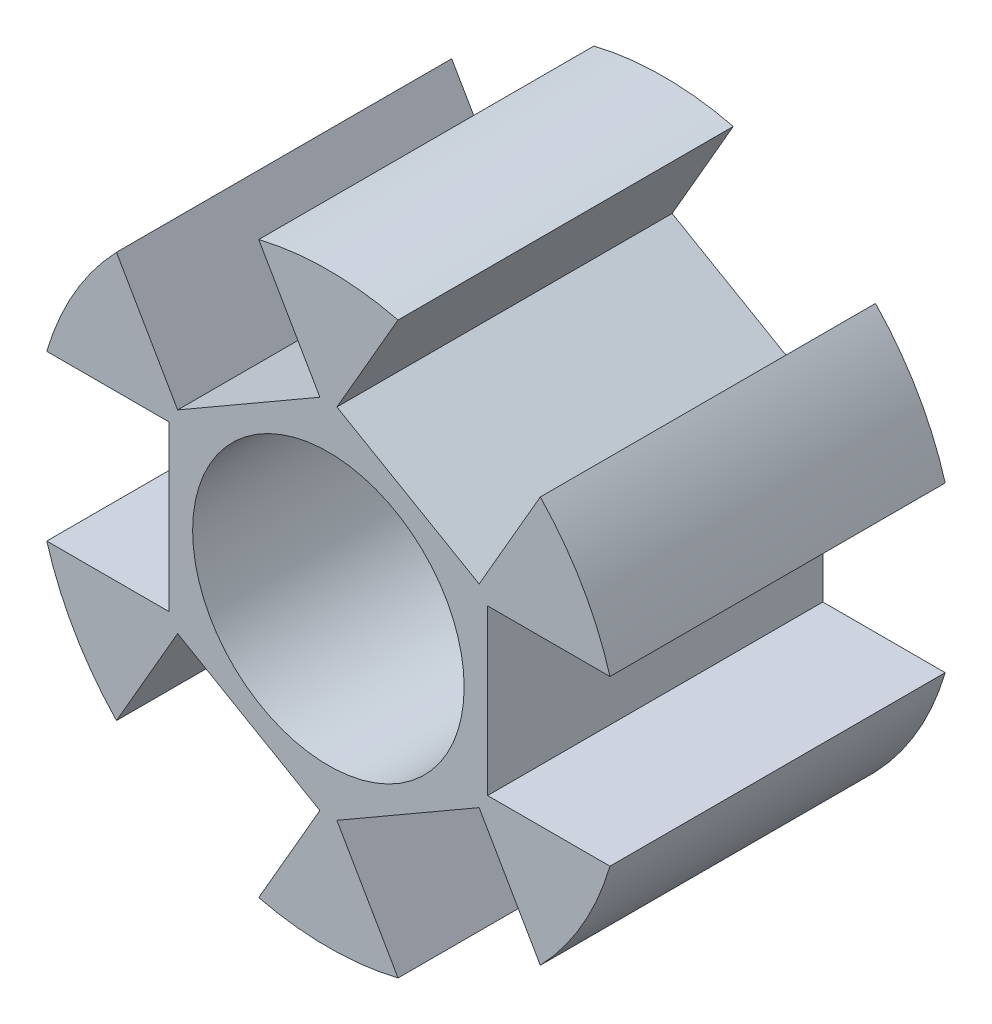
ISO-10303-21;
HEADER;
FILE_DESCRIPTION(('STEP AP214'),'2;1');
FILE_NAME('part.step','',(''),(''),'','','');
FILE_SCHEMA(('AUTOMOTIVE_DESIGN { 1 0 10303 214 1 1 1 1 }'));
ENDSEC;
DATA;
#1=APPLICATION_CONTEXT('core data for automotive mechanical design processes');
#2=APPLICATION_PROTOCOL_DEFINITION('international standard','automotive_design',2000,#1);
#3=PRODUCT_CONTEXT('',#1,'mechanical');
#4=PRODUCT('Part','Part','',(#3));
#5=PRODUCT_RELATED_PRODUCT_CATEGORY('part','',(#4));
#6=PRODUCT_DEFINITION_FORMATION('','',#4);
#7=PRODUCT_DEFINITION_CONTEXT('part definition',#1,'design');
#8=PRODUCT_DEFINITION('design','',#6,#7);
#9=PRODUCT_DEFINITION_SHAPE('','',#8);
#10=(LENGTH_UNIT() NAMED_UNIT(*) SI_UNIT(.MILLI.,.METRE.));
#11=(NAMED_UNIT(*) PLANE_ANGLE_UNIT() SI_UNIT($,.RADIAN.));
#12=(NAMED_UNIT(*) SI_UNIT($,.STERADIAN.) SOLID_ANGLE_UNIT());
#13=UNCERTAINTY_MEASURE_WITH_UNIT(LENGTH_MEASURE(1.E-05),#10,'distance_accuracy_value','');
#14=(GEOMETRIC_REPRESENTATION_CONTEXT(3) GLOBAL_UNCERTAINTY_ASSIGNED_CONTEXT((#13)) GLOBAL_UNIT_ASSIGNED_CONTEXT((#10,
#11,#12)) REPRESENTATION_CONTEXT('',''));
#15=CARTESIAN_POINT('',(0.,0.,0.));
#16=DIRECTION('',(0.,0.,1.));
#17=DIRECTION('',(1.,0.,0.));
#18=AXIS2_PLACEMENT_3D('',#15,#16,#17);
#19=CARTESIAN_POINT('',(0.,0.,5.));
#20=DIRECTION('',(0.,0.,1.));
#21=DIRECTION('',(1.,0.,0.));
#22=AXIS2_PLACEMENT_3D('',#19,#20,#21);
#23=PLANE('',#22);
#24=CARTESIAN_POINT('',(0.,0.,5.));
#25=DIRECTION('',(0.,0.,1.));
#26=DIRECTION('',(1.,0.,0.));
#27=AXIS2_PLACEMENT_3D('',#24,#25,#26);
#28=CIRCLE('',#27,4.05);
#29=CARTESIAN_POINT('',(4.05,0.,5.));
#30=VERTEX_POINT('',#29);
#31=EDGE_CURVE('E337',#30,#30,#28,.T.);
#32=ORIENTED_EDGE('',*,*,#31,.F.);
#33=EDGE_LOOP('',(#32));
#34=FACE_BOUND('',#33,.T.);
#35=DIRECTION('',(-0.866025403784433,-0.50000000000001,0.));
#36=VECTOR('',#35,1.);
#37=CARTESIAN_POINT('',(-0.253237760728186,5.33862066797608,5.));
#38=LINE('',#37,#36);
#39=CARTESIAN_POINT('',(-0.253237760728186,5.33862066797608,5.));
#40=VERTEX_POINT('',#39);
#41=CARTESIAN_POINT('',(-4.49676223927191,2.88862066797603,5.));
#42=VERTEX_POINT('',#41);
#43=EDGE_CURVE('E285',#40,#42,#38,.T.);
#44=ORIENTED_EDGE('',*,*,#43,.T.);
#45=DIRECTION('',(-0.50000000000001,0.866025403784433,0.));
#46=VECTOR('',#45,1.);
#47=CARTESIAN_POINT('',(-4.49676223927191,2.88862066797603,5.));
#48=LINE('',#47,#46);
#49=CARTESIAN_POINT('',(-6.32176223927195,6.04961339178921,5.));
#50=VERTEX_POINT('',#49);
#51=EDGE_CURVE('E290',#42,#50,#48,.T.);
#52=ORIENTED_EDGE('',*,*,#51,.T.);
#53=CARTESIAN_POINT('',(0.,0.,5.));
#54=DIRECTION('',(0.,0.,1.));
#55=DIRECTION('',(1.,0.,0.));
#56=AXIS2_PLACEMENT_3D('',#53,#54,#55);
#57=CIRCLE('',#56,8.75);
#58=CARTESIAN_POINT('',(-8.4,2.45,5.));
#59=VERTEX_POINT('',#58);
#60=EDGE_CURVE('E347',#50,#59,#57,.T.);
#61=ORIENTED_EDGE('',*,*,#60,.T.);
#62=DIRECTION('',(-1.,0.,0.));
#63=VECTOR('',#62,1.);
#64=CARTESIAN_POINT('',(-4.75,2.45,5.));
#65=LINE('',#64,#63);
#66=CARTESIAN_POINT('',(-4.75,2.45,5.));
#67=VERTEX_POINT('',#66);
#68=EDGE_CURVE('E327',#67,#59,#65,.T.);
#69=ORIENTED_EDGE('',*,*,#68,.F.);
#70=DIRECTION('',(0.,-1.,0.));
#71=VECTOR('',#70,1.);
#72=CARTESIAN_POINT('',(-4.75,2.45,5.));
#73=LINE('',#72,#71);
#74=CARTESIAN_POINT('',(-4.75,-2.45,5.));
#75=VERTEX_POINT('',#74);
#76=EDGE_CURVE('E321',#67,#75,#73,.T.);
#77=ORIENTED_EDGE('',*,*,#76,.T.);
#78=DIRECTION('',(-1.,0.,0.));
#79=VECTOR('',#78,1.);
#80=CARTESIAN_POINT('',(-4.75,-2.45,5.));
#81=LINE('',#80,#79);
#82=CARTESIAN_POINT('',(-8.4,-2.45,5.));
#83=VERTEX_POINT('',#82);
#84=EDGE_CURVE('E323',#75,#83,#81,.T.);
#85=ORIENTED_EDGE('',*,*,#84,.T.);
#86=CARTESIAN_POINT('',(-6.32176223927186,-6.0496133917893,5.));
#87=VERTEX_POINT('',#86);
#88=EDGE_CURVE('E342',#83,#87,#57,.T.);
#89=ORIENTED_EDGE('',*,*,#88,.T.);
#90=DIRECTION('',(-0.499999999999998,-0.86602540378444,0.));
#91=VECTOR('',#90,1.);
#92=CARTESIAN_POINT('',(-4.49676223927187,-2.88862066797609,5.));
#93=LINE('',#92,#91);
#94=CARTESIAN_POINT('',(-4.49676223927187,-2.88862066797609,5.));
#95=VERTEX_POINT('',#94);
#96=EDGE_CURVE('E306',#95,#87,#93,.T.);
#97=ORIENTED_EDGE('',*,*,#96,.F.);
#98=DIRECTION('',(0.86602540378444,-0.499999999999998,0.));
#99=VECTOR('',#98,1.);
#100=CARTESIAN_POINT('',(-4.49676223927187,-2.88862066797609,5.));
#101=LINE('',#100,#99);
#102=CARTESIAN_POINT('',(-0.253237760728112,-5.33862066797608,5.));
#103=VERTEX_POINT('',#102);
#104=EDGE_CURVE('E297',#95,#103,#101,.T.);
#105=ORIENTED_EDGE('',*,*,#104,.T.);
#106=DIRECTION('',(-0.499999999999998,-0.86602540378444,0.));
#107=VECTOR('',#106,1.);
#108=CARTESIAN_POINT('',(-0.253237760728112,-5.33862066797608,5.));
#109=LINE('',#108,#107);
#110=CARTESIAN_POINT('',(-2.07823776072811,-8.49961339178929,5.));
#111=VERTEX_POINT('',#110);
#112=EDGE_CURVE('E303',#103,#111,#109,.T.);
#113=ORIENTED_EDGE('',*,*,#112,.T.);
#114=CARTESIAN_POINT('',(2.07823776072817,-8.49961339178928,5.));
#115=VERTEX_POINT('',#114);
#116=EDGE_CURVE('E346',#111,#115,#57,.T.);
#117=ORIENTED_EDGE('',*,*,#116,.T.);
#118=DIRECTION('',(0.500000000000004,-0.866025403784436,0.));
#119=VECTOR('',#118,1.);
#120=CARTESIAN_POINT('',(0.253237760728149,-5.33862066797608,5.));
#121=LINE('',#120,#119);
#122=CARTESIAN_POINT('',(0.253237760728149,-5.33862066797608,5.));
#123=VERTEX_POINT('',#122);
#124=EDGE_CURVE('E231',#123,#115,#121,.T.);
#125=ORIENTED_EDGE('',*,*,#124,.F.);
#126=DIRECTION('',(0.866025403784436,0.500000000000004,0.));
#127=VECTOR('',#126,1.);
#128=CARTESIAN_POINT('',(0.253237760728149,-5.33862066797608,5.));
#129=LINE('',#128,#127);
#130=CARTESIAN_POINT('',(4.49676223927189,-2.88862066797606,5.));
#131=VERTEX_POINT('',#130);
#132=EDGE_CURVE('E516',#123,#131,#129,.T.);
#133=ORIENTED_EDGE('',*,*,#132,.T.);
#134=DIRECTION('',(0.500000000000004,-0.866025403784436,0.));
#135=VECTOR('',#134,1.);
#136=CARTESIAN_POINT('',(4.49676223927189,-2.88862066797606,5.));
#137=LINE('',#136,#135);
#138=CARTESIAN_POINT('',(6.3217622392719,-6.04961339178926,5.));
#139=VERTEX_POINT('',#138);
#140=EDGE_CURVE('E219',#131,#139,#137,.T.);
#141=ORIENTED_EDGE('',*,*,#140,.T.);
#142=CARTESIAN_POINT('',(8.4,-2.45,5.));
#143=VERTEX_POINT('',#142);
#144=EDGE_CURVE('E430',#139,#143,#57,.T.);
#145=ORIENTED_EDGE('',*,*,#144,.T.);
#146=DIRECTION('',(1.,0.,0.));
#147=VECTOR('',#146,1.);
#148=CARTESIAN_POINT('',(4.75,-2.45,5.));
#149=LINE('',#148,#147);
#150=CARTESIAN_POINT('',(4.75,-2.45,5.));
#151=VERTEX_POINT('',#150);
#152=EDGE_CURVE('E255',#151,#143,#149,.T.);
#153=ORIENTED_EDGE('',*,*,#152,.F.);
#154=DIRECTION('',(0.,1.,0.));
#155=VECTOR('',#154,1.);
#156=CARTESIAN_POINT('',(4.75,-2.45,5.));
#157=LINE('',#156,#155);
#158=CARTESIAN_POINT('',(4.75,2.45,5.));
#159=VERTEX_POINT('',#158);
#160=EDGE_CURVE('E246',#151,#159,#157,.T.);
#161=ORIENTED_EDGE('',*,*,#160,.T.);
#162=DIRECTION('',(1.,0.,0.));
#163=VECTOR('',#162,1.);
#164=CARTESIAN_POINT('',(4.75,2.45,5.));
#165=LINE('',#164,#163);
#166=CARTESIAN_POINT('',(8.4,2.45,5.));
#167=VERTEX_POINT('',#166);
#168=EDGE_CURVE('E248',#159,#167,#165,.T.);
#169=ORIENTED_EDGE('',*,*,#168,.T.);
#170=CARTESIAN_POINT('',(6.32176223927182,6.04961339178935,5.));
#171=VERTEX_POINT('',#170);
#172=EDGE_CURVE('E429',#167,#171,#57,.T.);
#173=ORIENTED_EDGE('',*,*,#172,.T.);
#174=DIRECTION('',(0.499999999999992,0.866025403784443,0.));
#175=VECTOR('',#174,1.);
#176=CARTESIAN_POINT('',(4.49676223927185,2.88862066797612,5.));
#177=LINE('',#176,#175);
#178=CARTESIAN_POINT('',(4.49676223927185,2.88862066797612,5.));
#179=VERTEX_POINT('',#178);
#180=EDGE_CURVE('E63',#179,#171,#177,.T.);
#181=ORIENTED_EDGE('',*,*,#180,.F.);
#182=DIRECTION('',(-0.866025403784443,0.499999999999992,0.));
#183=VECTOR('',#182,1.);
#184=CARTESIAN_POINT('',(4.49676223927185,2.88862066797612,5.));
#185=LINE('',#184,#183);
#186=CARTESIAN_POINT('',(0.253237760728075,5.33862066797609,5.));
#187=VERTEX_POINT('',#186);
#188=EDGE_CURVE('E269',#179,#187,#185,.T.);
#189=ORIENTED_EDGE('',*,*,#188,.T.);
#190=DIRECTION('',(0.499999999999992,0.866025403784443,0.));
#191=VECTOR('',#190,1.);
#192=CARTESIAN_POINT('',(0.253237760728075,5.33862066797609,5.));
#193=LINE('',#192,#191);
#194=CARTESIAN_POINT('',(2.07823776072805,8.49961339178931,5.));
#195=VERTEX_POINT('',#194);
#196=EDGE_CURVE('E268',#187,#195,#193,.T.);
#197=ORIENTED_EDGE('',*,*,#196,.T.);
#198=CARTESIAN_POINT('',(-2.07823776072823,8.49961339178926,5.));
#199=VERTEX_POINT('',#198);
#200=EDGE_CURVE('E433',#195,#199,#57,.T.);
#201=ORIENTED_EDGE('',*,*,#200,.T.);
#202=DIRECTION('',(-0.50000000000001,0.866025403784433,0.));
#203=VECTOR('',#202,1.);
#204=CARTESIAN_POINT('',(-0.253237760728186,5.33862066797608,5.));
#205=LINE('',#204,#203);
#206=EDGE_CURVE('E57',#40,#199,#205,.T.);
#207=ORIENTED_EDGE('',*,*,#206,.F.);
#208=EDGE_LOOP('',(#44,#52,#61,#69,#77,#85,#89,#97,#105,#113,#117,#125,#133,#141,#145,#153,#161,
#169,#173,#181,#189,#197,#201,#207));
#209=FACE_BOUND('',#208,.T.);
#210=ADVANCED_FACE('F41',(#34,#209),#23,.T.);
#211=CARTESIAN_POINT('',(0.,0.,-5.));
#212=DIRECTION('',(0.,0.,1.));
#213=DIRECTION('',(1.,0.,0.));
#214=AXIS2_PLACEMENT_3D('',#211,#212,#213);
#215=PLANE('',#214);
#216=CARTESIAN_POINT('',(0.,0.,-5.));
#217=DIRECTION('',(0.,0.,1.));
#218=DIRECTION('',(1.,0.,0.));
#219=AXIS2_PLACEMENT_3D('',#216,#217,#218);
#220=CIRCLE('',#219,4.05);
#221=CARTESIAN_POINT('',(4.05,0.,-5.));
#222=VERTEX_POINT('',#221);
#223=EDGE_CURVE('E332',#222,#222,#220,.T.);
#224=ORIENTED_EDGE('',*,*,#223,.T.);
#225=EDGE_LOOP('',(#224));
#226=FACE_BOUND('',#225,.T.);
#227=DIRECTION('',(-0.50000000000001,0.866025403784433,0.));
#228=VECTOR('',#227,1.);
#229=CARTESIAN_POINT('',(-4.49676223927191,2.88862066797603,-5.));
#230=LINE('',#229,#228);
#231=CARTESIAN_POINT('',(-4.49676223927191,2.88862066797603,-5.));
#232=VERTEX_POINT('',#231);
#233=CARTESIAN_POINT('',(-6.32176223927195,6.04961339178921,-5.));
#234=VERTEX_POINT('',#233);
#235=EDGE_CURVE('E261',#232,#234,#230,.T.);
#236=ORIENTED_EDGE('',*,*,#235,.F.);
#237=DIRECTION('',(0.866025403784433,0.50000000000001,0.));
#238=VECTOR('',#237,1.);
#239=CARTESIAN_POINT('',(-0.253237760728186,5.33862066797608,-5.));
#240=LINE('',#239,#238);
#241=CARTESIAN_POINT('',(-0.253237760728186,5.33862066797608,-5.));
#242=VERTEX_POINT('',#241);
#243=EDGE_CURVE('E280',#232,#242,#240,.T.);
#244=ORIENTED_EDGE('',*,*,#243,.T.);
#245=DIRECTION('',(-0.50000000000001,0.866025403784433,0.));
#246=VECTOR('',#245,1.);
#247=CARTESIAN_POINT('',(-0.253237760728186,5.33862066797608,-5.));
#248=LINE('',#247,#246);
#249=CARTESIAN_POINT('',(-2.07823776072823,8.49961339178926,-5.));
#250=VERTEX_POINT('',#249);
#251=EDGE_CURVE('E292',#242,#250,#248,.T.);
#252=ORIENTED_EDGE('',*,*,#251,.T.);
#253=CARTESIAN_POINT('',(0.,0.,-5.));
#254=DIRECTION('',(0.,0.,1.));
#255=DIRECTION('',(1.,0.,0.));
#256=AXIS2_PLACEMENT_3D('',#253,#254,#255);
#257=CIRCLE('',#256,8.75);
#258=CARTESIAN_POINT('',(2.07823776072805,8.49961339178931,-5.));
#259=VERTEX_POINT('',#258);
#260=EDGE_CURVE('E378',#259,#250,#257,.T.);
#261=ORIENTED_EDGE('',*,*,#260,.F.);
#262=DIRECTION('',(0.499999999999992,0.866025403784443,0.));
#263=VECTOR('',#262,1.);
#264=CARTESIAN_POINT('',(0.253237760728075,5.33862066797609,-5.));
#265=LINE('',#264,#263);
#266=CARTESIAN_POINT('',(0.253237760728075,5.33862066797609,-5.));
#267=VERTEX_POINT('',#266);
#268=EDGE_CURVE('E241',#267,#259,#265,.T.);
#269=ORIENTED_EDGE('',*,*,#268,.F.);
#270=DIRECTION('',(0.866025403784443,-0.499999999999992,0.));
#271=VECTOR('',#270,1.);
#272=CARTESIAN_POINT('',(4.49676223927185,2.88862066797612,-5.));
#273=LINE('',#272,#271);
#274=CARTESIAN_POINT('',(4.49676223927185,2.88862066797612,-5.));
#275=VERTEX_POINT('',#274);
#276=EDGE_CURVE('E260',#267,#275,#273,.T.);
#277=ORIENTED_EDGE('',*,*,#276,.T.);
#278=DIRECTION('',(0.499999999999992,0.866025403784443,0.));
#279=VECTOR('',#278,1.);
#280=CARTESIAN_POINT('',(4.49676223927185,2.88862066797612,-5.));
#281=LINE('',#280,#279);
#282=CARTESIAN_POINT('',(6.32176223927182,6.04961339178935,-5.));
#283=VERTEX_POINT('',#282);
#284=EDGE_CURVE('E271',#275,#283,#281,.T.);
#285=ORIENTED_EDGE('',*,*,#284,.T.);
#286=CARTESIAN_POINT('',(8.4,2.45,-5.));
#287=VERTEX_POINT('',#286);
#288=EDGE_CURVE('E385',#287,#283,#257,.T.);
#289=ORIENTED_EDGE('',*,*,#288,.F.);
#290=DIRECTION('',(1.,0.,0.));
#291=VECTOR('',#290,1.);
#292=CARTESIAN_POINT('',(4.75,2.45,-5.));
#293=LINE('',#292,#291);
#294=CARTESIAN_POINT('',(4.75,2.45,-5.));
#295=VERTEX_POINT('',#294);
#296=EDGE_CURVE('E218',#295,#287,#293,.T.);
#297=ORIENTED_EDGE('',*,*,#296,.F.);
#298=DIRECTION('',(0.,-1.,0.));
#299=VECTOR('',#298,1.);
#300=CARTESIAN_POINT('',(4.75,-2.45,-5.));
#301=LINE('',#300,#299);
#302=CARTESIAN_POINT('',(4.75,-2.45,-5.));
#303=VERTEX_POINT('',#302);
#304=EDGE_CURVE('E239',#295,#303,#301,.T.);
#305=ORIENTED_EDGE('',*,*,#304,.T.);
#306=DIRECTION('',(1.,0.,0.));
#307=VECTOR('',#306,1.);
#308=CARTESIAN_POINT('',(4.75,-2.45,-5.));
#309=LINE('',#308,#307);
#310=CARTESIAN_POINT('',(8.4,-2.45,-5.));
#311=VERTEX_POINT('',#310);
#312=EDGE_CURVE('E251',#303,#311,#309,.T.);
#313=ORIENTED_EDGE('',*,*,#312,.T.);
#314=CARTESIAN_POINT('',(6.3217622392719,-6.04961339178926,-5.));
#315=VERTEX_POINT('',#314);
#316=EDGE_CURVE('E228',#315,#311,#257,.T.);
#317=ORIENTED_EDGE('',*,*,#316,.F.);
#318=DIRECTION('',(0.500000000000004,-0.866025403784436,0.));
#319=VECTOR('',#318,1.);
#320=CARTESIAN_POINT('',(4.49676223927189,-2.88862066797606,-5.));
#321=LINE('',#320,#319);
#322=CARTESIAN_POINT('',(4.49676223927189,-2.88862066797606,-5.));
#323=VERTEX_POINT('',#322);
#324=EDGE_CURVE('E215',#323,#315,#321,.T.);
#325=ORIENTED_EDGE('',*,*,#324,.F.);
#326=DIRECTION('',(-0.866025403784436,-0.500000000000004,0.));
#327=VECTOR('',#326,1.);
#328=CARTESIAN_POINT('',(0.253237760728149,-5.33862066797608,-5.));
#329=LINE('',#328,#327);
#330=CARTESIAN_POINT('',(0.253237760728149,-5.33862066797608,-5.));
#331=VERTEX_POINT('',#330);
#332=EDGE_CURVE('E201',#323,#331,#329,.T.);
#333=ORIENTED_EDGE('',*,*,#332,.T.);
#334=DIRECTION('',(0.500000000000004,-0.866025403784436,0.));
#335=VECTOR('',#334,1.);
#336=CARTESIAN_POINT('',(0.253237760728149,-5.33862066797608,-5.));
#337=LINE('',#336,#335);
#338=CARTESIAN_POINT('',(2.07823776072816,-8.49961339178928,-5.));
#339=VERTEX_POINT('',#338);
#340=EDGE_CURVE('E226',#331,#339,#337,.T.);
#341=ORIENTED_EDGE('',*,*,#340,.T.);
#342=CARTESIAN_POINT('',(-2.07823776072811,-8.49961339178929,-5.));
#343=VERTEX_POINT('',#342);
#344=EDGE_CURVE('E354',#343,#339,#257,.T.);
#345=ORIENTED_EDGE('',*,*,#344,.F.);
#346=DIRECTION('',(-0.499999999999998,-0.86602540378444,0.));
#347=VECTOR('',#346,1.);
#348=CARTESIAN_POINT('',(-0.253237760728112,-5.33862066797608,-5.));
#349=LINE('',#348,#347);
#350=CARTESIAN_POINT('',(-0.253237760728112,-5.33862066797608,-5.));
#351=VERTEX_POINT('',#350);
#352=EDGE_CURVE('E311',#351,#343,#349,.T.);
#353=ORIENTED_EDGE('',*,*,#352,.F.);
#354=DIRECTION('',(-0.86602540378444,0.499999999999998,0.));
#355=VECTOR('',#354,1.);
#356=CARTESIAN_POINT('',(-4.49676223927187,-2.88862066797609,-5.));
#357=LINE('',#356,#355);
#358=CARTESIAN_POINT('',(-4.49676223927187,-2.88862066797609,-5.));
#359=VERTEX_POINT('',#358);
#360=EDGE_CURVE('E233',#351,#359,#357,.T.);
#361=ORIENTED_EDGE('',*,*,#360,.T.);
#362=DIRECTION('',(-0.499999999999998,-0.86602540378444,0.));
#363=VECTOR('',#362,1.);
#364=CARTESIAN_POINT('',(-4.49676223927187,-2.88862066797609,-5.));
#365=LINE('',#364,#363);
#366=CARTESIAN_POINT('',(-6.32176223927186,-6.0496133917893,-5.));
#367=VERTEX_POINT('',#366);
#368=EDGE_CURVE('E308',#359,#367,#365,.T.);
#369=ORIENTED_EDGE('',*,*,#368,.T.);
#370=CARTESIAN_POINT('',(-8.4,-2.45,-5.));
#371=VERTEX_POINT('',#370);
#372=EDGE_CURVE('E349',#371,#367,#257,.T.);
#373=ORIENTED_EDGE('',*,*,#372,.F.);
#374=DIRECTION('',(-1.,0.,0.));
#375=VECTOR('',#374,1.);
#376=CARTESIAN_POINT('',(-4.75,-2.45,-5.));
#377=LINE('',#376,#375);
#378=CARTESIAN_POINT('',(-4.75,-2.45,-5.));
#379=VERTEX_POINT('',#378);
#380=EDGE_CURVE('E335',#379,#371,#377,.T.);
#381=ORIENTED_EDGE('',*,*,#380,.F.);
#382=DIRECTION('',(0.,1.,0.));
#383=VECTOR('',#382,1.);
#384=CARTESIAN_POINT('',(-4.75,2.45,-5.));
#385=LINE('',#384,#383);
#386=CARTESIAN_POINT('',(-4.75,2.45,-5.));
#387=VERTEX_POINT('',#386);
#388=EDGE_CURVE('E317',#379,#387,#385,.T.);
#389=ORIENTED_EDGE('',*,*,#388,.T.);
#390=DIRECTION('',(-1.,0.,0.));
#391=VECTOR('',#390,1.);
#392=CARTESIAN_POINT('',(-4.75,2.45,-5.));
#393=LINE('',#392,#391);
#394=CARTESIAN_POINT('',(-8.4,2.45,-5.));
#395=VERTEX_POINT('',#394);
#396=EDGE_CURVE('E330',#387,#395,#393,.T.);
#397=ORIENTED_EDGE('',*,*,#396,.T.);
#398=EDGE_CURVE('E339',#234,#395,#257,.T.);
#399=ORIENTED_EDGE('',*,*,#398,.F.);
#400=EDGE_LOOP('',(#236,#244,#252,#261,#269,#277,#285,#289,#297,#305,#313,#317,#325,#333,#341,
#345,#353,#361,#369,#373,#381,#389,#397,#399));
#401=FACE_BOUND('',#400,.T.);
#402=ADVANCED_FACE('F225',(#226,#401),#215,.F.);
#403=CARTESIAN_POINT('',(0.,0.,5.));
#404=DIRECTION('',(0.,0.,-1.));
#405=DIRECTION('',(-1.,0.,0.));
#406=AXIS2_PLACEMENT_3D('',#403,#404,#405);
#407=CYLINDRICAL_SURFACE('',#406,8.75);
#408=DIRECTION('',(0.,0.,-1.));
#409=VECTOR('',#408,1.);
#410=CARTESIAN_POINT('',(-6.32176223927195,6.04961339178921,5.));
#411=LINE('',#410,#409);
#412=EDGE_CURVE('E11',#234,#50,#411,.F.);
#413=ORIENTED_EDGE('',*,*,#412,.F.);
#414=ORIENTED_EDGE('',*,*,#398,.T.);
#415=DIRECTION('',(0.,0.,-1.));
#416=VECTOR('',#415,1.);
#417=CARTESIAN_POINT('',(-8.4,2.45,5.));
#418=LINE('',#417,#416);
#419=EDGE_CURVE('E345',#59,#395,#418,.T.);
#420=ORIENTED_EDGE('',*,*,#419,.F.);
#421=ORIENTED_EDGE('',*,*,#60,.F.);
#422=EDGE_LOOP('',(#413,#414,#420,#421));
#423=FACE_BOUND('',#422,.T.);
#424=ADVANCED_FACE('F43',(#423),#407,.T.);
#425=DIRECTION('',(0.,0.,-1.));
#426=VECTOR('',#425,1.);
#427=CARTESIAN_POINT('',(-2.07823776072823,8.49961339178926,5.));
#428=LINE('',#427,#426);
#429=EDGE_CURVE('E47',#199,#250,#428,.T.);
#430=ORIENTED_EDGE('',*,*,#429,.F.);
#431=ORIENTED_EDGE('',*,*,#200,.F.);
#432=DIRECTION('',(0.,0.,-1.));
#433=VECTOR('',#432,1.);
#434=CARTESIAN_POINT('',(2.07823776072805,8.49961339178931,5.));
#435=LINE('',#434,#433);
#436=EDGE_CURVE('E369',#259,#195,#435,.F.);
#437=ORIENTED_EDGE('',*,*,#436,.F.);
#438=ORIENTED_EDGE('',*,*,#260,.T.);
#439=EDGE_LOOP('',(#430,#431,#437,#438));
#440=FACE_BOUND('',#439,.T.);
#441=ADVANCED_FACE('F382',(#440),#407,.T.);
#442=DIRECTION('',(0.,0.,-1.));
#443=VECTOR('',#442,1.);
#444=CARTESIAN_POINT('',(6.32176223927182,6.04961339178935,5.));
#445=LINE('',#444,#443);
#446=EDGE_CURVE('E368',#171,#283,#445,.T.);
#447=ORIENTED_EDGE('',*,*,#446,.F.);
#448=ORIENTED_EDGE('',*,*,#172,.F.);
#449=DIRECTION('',(0.,0.,-1.));
#450=VECTOR('',#449,1.);
#451=CARTESIAN_POINT('',(8.4,2.45,5.));
#452=LINE('',#451,#450);
#453=EDGE_CURVE('E366',#287,#167,#452,.F.);
#454=ORIENTED_EDGE('',*,*,#453,.F.);
#455=ORIENTED_EDGE('',*,*,#288,.T.);
#456=EDGE_LOOP('',(#447,#448,#454,#455));
#457=FACE_BOUND('',#456,.T.);
#458=ADVANCED_FACE('F504',(#457),#407,.T.);
#459=DIRECTION('',(0.,0.,-1.));
#460=VECTOR('',#459,1.);
#461=CARTESIAN_POINT('',(8.4,-2.45,5.));
#462=LINE('',#461,#460);
#463=EDGE_CURVE('E364',#143,#311,#462,.T.);
#464=ORIENTED_EDGE('',*,*,#463,.F.);
#465=ORIENTED_EDGE('',*,*,#144,.F.);
#466=DIRECTION('',(0.,0.,-1.));
#467=VECTOR('',#466,1.);
#468=CARTESIAN_POINT('',(6.3217622392719,-6.04961339178926,5.));
#469=LINE('',#468,#467);
#470=EDGE_CURVE('E365',#315,#139,#469,.F.);
#471=ORIENTED_EDGE('',*,*,#470,.F.);
#472=ORIENTED_EDGE('',*,*,#316,.T.);
#473=EDGE_LOOP('',(#464,#465,#471,#472));
#474=FACE_BOUND('',#473,.T.);
#475=ADVANCED_FACE('F514',(#474),#407,.T.);
#476=DIRECTION('',(0.,0.,-1.));
#477=VECTOR('',#476,1.);
#478=CARTESIAN_POINT('',(2.07823776072816,-8.49961339178928,5.));
#479=LINE('',#478,#477);
#480=EDGE_CURVE('E359',#115,#339,#479,.T.);
#481=ORIENTED_EDGE('',*,*,#480,.F.);
#482=ORIENTED_EDGE('',*,*,#116,.F.);
#483=DIRECTION('',(0.,0.,-1.));
#484=VECTOR('',#483,1.);
#485=CARTESIAN_POINT('',(-2.07823776072811,-8.49961339178929,5.));
#486=LINE('',#485,#484);
#487=EDGE_CURVE('E356',#343,#111,#486,.F.);
#488=ORIENTED_EDGE('',*,*,#487,.F.);
#489=ORIENTED_EDGE('',*,*,#344,.T.);
#490=EDGE_LOOP('',(#481,#482,#488,#489));
#491=FACE_BOUND('',#490,.T.);
#492=ADVANCED_FACE('F424',(#491),#407,.T.);
#493=DIRECTION('',(0.,0.,-1.));
#494=VECTOR('',#493,1.);
#495=CARTESIAN_POINT('',(-6.32176223927186,-6.0496133917893,5.));
#496=LINE('',#495,#494);
#497=EDGE_CURVE('E358',#87,#367,#496,.T.);
#498=ORIENTED_EDGE('',*,*,#497,.F.);
#499=ORIENTED_EDGE('',*,*,#88,.F.);
#500=DIRECTION('',(0.,0.,-1.));
#501=VECTOR('',#500,1.);
#502=CARTESIAN_POINT('',(-8.4,-2.45,5.));
#503=LINE('',#502,#501);
#504=EDGE_CURVE('E353',#371,#83,#503,.F.);
#505=ORIENTED_EDGE('',*,*,#504,.F.);
#506=ORIENTED_EDGE('',*,*,#372,.T.);
#507=EDGE_LOOP('',(#498,#499,#505,#506));
#508=FACE_BOUND('',#507,.T.);
#509=ADVANCED_FACE('F407',(#508),#407,.T.);
#510=CARTESIAN_POINT('',(0.,0.,5.));
#511=DIRECTION('',(0.,0.,-1.));
#512=DIRECTION('',(-1.,0.,0.));
#513=AXIS2_PLACEMENT_3D('',#510,#511,#512);
#514=CYLINDRICAL_SURFACE('',#513,4.05);
#515=ORIENTED_EDGE('',*,*,#31,.T.);
#516=EDGE_LOOP('',(#515));
#517=FACE_BOUND('',#516,.T.);
#518=ORIENTED_EDGE('',*,*,#223,.F.);
#519=EDGE_LOOP('',(#518));
#520=FACE_BOUND('',#519,.T.);
#521=ADVANCED_FACE('F459',(#517,#520),#514,.F.);
#522=CARTESIAN_POINT('',(-4.75,-2.45,5.));
#523=DIRECTION('',(0.,1.,0.));
#524=DIRECTION('',(0.,0.,1.));
#525=AXIS2_PLACEMENT_3D('',#522,#523,#524);
#526=PLANE('',#525);
#527=ORIENTED_EDGE('',*,*,#504,.T.);
#528=ORIENTED_EDGE('',*,*,#84,.F.);
#529=DIRECTION('',(0.,0.,-1.));
#530=VECTOR('',#529,1.);
#531=CARTESIAN_POINT('',(-4.75,-2.45,5.));
#532=LINE('',#531,#530);
#533=EDGE_CURVE('E312',#75,#379,#532,.T.);
#534=ORIENTED_EDGE('',*,*,#533,.T.);
#535=ORIENTED_EDGE('',*,*,#380,.T.);
#536=EDGE_LOOP('',(#527,#528,#534,#535));
#537=FACE_BOUND('',#536,.T.);
#538=ADVANCED_FACE('F397',(#537),#526,.T.);
#539=CARTESIAN_POINT('',(-4.75,2.45,5.));
#540=DIRECTION('',(0.,-1.,0.));
#541=DIRECTION('',(0.,0.,-1.));
#542=AXIS2_PLACEMENT_3D('',#539,#540,#541);
#543=PLANE('',#542);
#544=ORIENTED_EDGE('',*,*,#419,.T.);
#545=ORIENTED_EDGE('',*,*,#396,.F.);
#546=DIRECTION('',(0.,0.,1.));
#547=VECTOR('',#546,1.);
#548=CARTESIAN_POINT('',(-4.75,2.45,5.));
#549=LINE('',#548,#547);
#550=EDGE_CURVE('E316',#387,#67,#549,.T.);
#551=ORIENTED_EDGE('',*,*,#550,.T.);
#552=ORIENTED_EDGE('',*,*,#68,.T.);
#553=EDGE_LOOP('',(#544,#545,#551,#552));
#554=FACE_BOUND('',#553,.T.);
#555=ADVANCED_FACE('F390',(#554),#543,.T.);
#556=CARTESIAN_POINT('',(-4.75,0.,0.));
#557=DIRECTION('',(-1.,0.,0.));
#558=DIRECTION('',(0.,0.,1.));
#559=AXIS2_PLACEMENT_3D('',#556,#557,#558);
#560=PLANE('',#559);
#561=ORIENTED_EDGE('',*,*,#533,.F.);
#562=ORIENTED_EDGE('',*,*,#76,.F.);
#563=ORIENTED_EDGE('',*,*,#550,.F.);
#564=ORIENTED_EDGE('',*,*,#388,.F.);
#565=EDGE_LOOP('',(#561,#562,#563,#564));
#566=FACE_BOUND('',#565,.T.);
#567=ADVANCED_FACE('F396',(#566),#560,.T.);
#568=CARTESIAN_POINT('',(-0.253237760728112,-5.33862066797608,5.));
#569=DIRECTION('',(-0.86602540378444,0.499999999999998,0.));
#570=DIRECTION('',(-0.499999999999998,-0.86602540378444,0.));
#571=AXIS2_PLACEMENT_3D('',#568,#569,#570);
#572=PLANE('',#571);
#573=ORIENTED_EDGE('',*,*,#487,.T.);
#574=ORIENTED_EDGE('',*,*,#112,.F.);
#575=DIRECTION('',(0.,0.,-1.));
#576=VECTOR('',#575,1.);
#577=CARTESIAN_POINT('',(-0.253237760728112,-5.33862066797608,5.));
#578=LINE('',#577,#576);
#579=EDGE_CURVE('E227',#103,#351,#578,.T.);
#580=ORIENTED_EDGE('',*,*,#579,.T.);
#581=ORIENTED_EDGE('',*,*,#352,.T.);
#582=EDGE_LOOP('',(#573,#574,#580,#581));
#583=FACE_BOUND('',#582,.T.);
#584=ADVANCED_FACE('F420',(#583),#572,.T.);
#585=CARTESIAN_POINT('',(-4.49676223927187,-2.88862066797609,5.));
#586=DIRECTION('',(0.86602540378444,-0.499999999999998,0.));
#587=DIRECTION('',(0.499999999999998,0.86602540378444,0.));
#588=AXIS2_PLACEMENT_3D('',#585,#586,#587);
#589=PLANE('',#588);
#590=ORIENTED_EDGE('',*,*,#497,.T.);
#591=ORIENTED_EDGE('',*,*,#368,.F.);
#592=DIRECTION('',(0.,0.,1.));
#593=VECTOR('',#592,1.);
#594=CARTESIAN_POINT('',(-4.49676223927187,-2.88862066797609,5.));
#595=LINE('',#594,#593);
#596=EDGE_CURVE('E296',#359,#95,#595,.T.);
#597=ORIENTED_EDGE('',*,*,#596,.T.);
#598=ORIENTED_EDGE('',*,*,#96,.T.);
#599=EDGE_LOOP('',(#590,#591,#597,#598));
#600=FACE_BOUND('',#599,.T.);
#601=ADVANCED_FACE('F408',(#600),#589,.T.);
#602=CARTESIAN_POINT('',(-2.37499999999999,-4.11362066797609,0.));
#603=DIRECTION('',(-0.499999999999998,-0.86602540378444,0.));
#604=DIRECTION('',(0.,0.,1.));
#605=AXIS2_PLACEMENT_3D('',#602,#603,#604);
#606=PLANE('',#605);
#607=ORIENTED_EDGE('',*,*,#579,.F.);
#608=ORIENTED_EDGE('',*,*,#104,.F.);
#609=ORIENTED_EDGE('',*,*,#596,.F.);
#610=ORIENTED_EDGE('',*,*,#360,.F.);
#611=EDGE_LOOP('',(#607,#608,#609,#610));
#612=FACE_BOUND('',#611,.T.);
#613=ADVANCED_FACE('F415',(#612),#606,.T.);
#614=CARTESIAN_POINT('',(4.49676223927189,-2.88862066797606,5.));
#615=DIRECTION('',(-0.866025403784436,-0.500000000000004,0.));
#616=DIRECTION('',(0.500000000000004,-0.866025403784436,0.));
#617=AXIS2_PLACEMENT_3D('',#614,#615,#616);
#618=PLANE('',#617);
#619=ORIENTED_EDGE('',*,*,#470,.T.);
#620=ORIENTED_EDGE('',*,*,#140,.F.);
#621=DIRECTION('',(0.,0.,-1.));
#622=VECTOR('',#621,1.);
#623=CARTESIAN_POINT('',(4.49676223927189,-2.88862066797606,5.));
#624=LINE('',#623,#622);
#625=EDGE_CURVE('E207',#131,#323,#624,.T.);
#626=ORIENTED_EDGE('',*,*,#625,.T.);
#627=ORIENTED_EDGE('',*,*,#324,.T.);
#628=EDGE_LOOP('',(#619,#620,#626,#627));
#629=FACE_BOUND('',#628,.T.);
#630=ADVANCED_FACE('F213',(#629),#618,.T.);
#631=CARTESIAN_POINT('',(0.253237760728149,-5.33862066797608,5.));
#632=DIRECTION('',(0.866025403784436,0.500000000000004,0.));
#633=DIRECTION('',(-0.500000000000004,0.866025403784436,0.));
#634=AXIS2_PLACEMENT_3D('',#631,#632,#633);
#635=PLANE('',#634);
#636=ORIENTED_EDGE('',*,*,#480,.T.);
#637=ORIENTED_EDGE('',*,*,#340,.F.);
#638=DIRECTION('',(0.,0.,1.));
#639=VECTOR('',#638,1.);
#640=CARTESIAN_POINT('',(0.253237760728149,-5.33862066797608,5.));
#641=LINE('',#640,#639);
#642=EDGE_CURVE('E206',#331,#123,#641,.T.);
#643=ORIENTED_EDGE('',*,*,#642,.T.);
#644=ORIENTED_EDGE('',*,*,#124,.T.);
#645=EDGE_LOOP('',(#636,#637,#643,#644));
#646=FACE_BOUND('',#645,.T.);
#647=ADVANCED_FACE('F513',(#646),#635,.T.);
#648=CARTESIAN_POINT('',(2.37500000000002,-4.11362066797607,0.));
#649=DIRECTION('',(0.500000000000004,-0.866025403784436,0.));
#650=DIRECTION('',(0.,0.,1.));
#651=AXIS2_PLACEMENT_3D('',#648,#649,#650);
#652=PLANE('',#651);
#653=ORIENTED_EDGE('',*,*,#625,.F.);
#654=ORIENTED_EDGE('',*,*,#132,.F.);
#655=ORIENTED_EDGE('',*,*,#642,.F.);
#656=ORIENTED_EDGE('',*,*,#332,.F.);
#657=EDGE_LOOP('',(#653,#654,#655,#656));
#658=FACE_BOUND('',#657,.T.);
#659=ADVANCED_FACE('F203',(#658),#652,.T.);
#660=CARTESIAN_POINT('',(4.75,2.45,5.));
#661=DIRECTION('',(0.,-1.,0.));
#662=DIRECTION('',(0.,0.,-1.));
#663=AXIS2_PLACEMENT_3D('',#660,#661,#662);
#664=PLANE('',#663);
#665=ORIENTED_EDGE('',*,*,#453,.T.);
#666=ORIENTED_EDGE('',*,*,#168,.F.);
#667=DIRECTION('',(0.,0.,-1.));
#668=VECTOR('',#667,1.);
#669=CARTESIAN_POINT('',(4.75,2.45,5.));
#670=LINE('',#669,#668);
#671=EDGE_CURVE('E240',#159,#295,#670,.T.);
#672=ORIENTED_EDGE('',*,*,#671,.T.);
#673=ORIENTED_EDGE('',*,*,#296,.T.);
#674=EDGE_LOOP('',(#665,#666,#672,#673));
#675=FACE_BOUND('',#674,.T.);
#676=ADVANCED_FACE('F486',(#675),#664,.T.);
#677=CARTESIAN_POINT('',(4.75,-2.45,5.));
#678=DIRECTION('',(0.,1.,0.));
#679=DIRECTION('',(0.,0.,1.));
#680=AXIS2_PLACEMENT_3D('',#677,#678,#679);
#681=PLANE('',#680);
#682=ORIENTED_EDGE('',*,*,#463,.T.);
#683=ORIENTED_EDGE('',*,*,#312,.F.);
#684=DIRECTION('',(0.,0.,1.));
#685=VECTOR('',#684,1.);
#686=CARTESIAN_POINT('',(4.75,-2.45,5.));
#687=LINE('',#686,#685);
#688=EDGE_CURVE('E242',#303,#151,#687,.T.);
#689=ORIENTED_EDGE('',*,*,#688,.T.);
#690=ORIENTED_EDGE('',*,*,#152,.T.);
#691=EDGE_LOOP('',(#682,#683,#689,#690));
#692=FACE_BOUND('',#691,.T.);
#693=ADVANCED_FACE('F496',(#692),#681,.T.);
#694=CARTESIAN_POINT('',(4.75,0.,0.));
#695=DIRECTION('',(1.,0.,0.));
#696=DIRECTION('',(0.,0.,1.));
#697=AXIS2_PLACEMENT_3D('',#694,#695,#696);
#698=PLANE('',#697);
#699=ORIENTED_EDGE('',*,*,#671,.F.);
#700=ORIENTED_EDGE('',*,*,#160,.F.);
#701=ORIENTED_EDGE('',*,*,#688,.F.);
#702=ORIENTED_EDGE('',*,*,#304,.F.);
#703=EDGE_LOOP('',(#699,#700,#701,#702));
#704=FACE_BOUND('',#703,.T.);
#705=ADVANCED_FACE('F493',(#704),#698,.T.);
#706=CARTESIAN_POINT('',(0.253237760728075,5.33862066797609,5.));
#707=DIRECTION('',(0.866025403784443,-0.499999999999992,0.));
#708=DIRECTION('',(0.499999999999992,0.866025403784443,0.));
#709=AXIS2_PLACEMENT_3D('',#706,#707,#708);
#710=PLANE('',#709);
#711=ORIENTED_EDGE('',*,*,#436,.T.);
#712=ORIENTED_EDGE('',*,*,#196,.F.);
#713=DIRECTION('',(0.,0.,-1.));
#714=VECTOR('',#713,1.);
#715=CARTESIAN_POINT('',(0.253237760728075,5.33862066797609,5.));
#716=LINE('',#715,#714);
#717=EDGE_CURVE('E257',#187,#267,#716,.T.);
#718=ORIENTED_EDGE('',*,*,#717,.T.);
#719=ORIENTED_EDGE('',*,*,#268,.T.);
#720=EDGE_LOOP('',(#711,#712,#718,#719));
#721=FACE_BOUND('',#720,.T.);
#722=ADVANCED_FACE('F483',(#721),#710,.T.);
#723=CARTESIAN_POINT('',(4.49676223927185,2.88862066797612,5.));
#724=DIRECTION('',(-0.866025403784443,0.499999999999992,0.));
#725=DIRECTION('',(-0.499999999999992,-0.866025403784443,0.));
#726=AXIS2_PLACEMENT_3D('',#723,#724,#725);
#727=PLANE('',#726);
#728=ORIENTED_EDGE('',*,*,#446,.T.);
#729=ORIENTED_EDGE('',*,*,#284,.F.);
#730=DIRECTION('',(0.,0.,1.));
#731=VECTOR('',#730,1.);
#732=CARTESIAN_POINT('',(4.49676223927185,2.88862066797612,5.));
#733=LINE('',#732,#731);
#734=EDGE_CURVE('E263',#275,#179,#733,.T.);
#735=ORIENTED_EDGE('',*,*,#734,.T.);
#736=ORIENTED_EDGE('',*,*,#180,.T.);
#737=EDGE_LOOP('',(#728,#729,#735,#736));
#738=FACE_BOUND('',#737,.T.);
#739=ADVANCED_FACE('F479',(#738),#727,.T.);
#740=CARTESIAN_POINT('',(2.37499999999996,4.1136206679761,0.));
#741=DIRECTION('',(0.499999999999992,0.866025403784443,0.));
#742=DIRECTION('',(0.,0.,1.));
#743=AXIS2_PLACEMENT_3D('',#740,#741,#742);
#744=PLANE('',#743);
#745=ORIENTED_EDGE('',*,*,#717,.F.);
#746=ORIENTED_EDGE('',*,*,#188,.F.);
#747=ORIENTED_EDGE('',*,*,#734,.F.);
#748=ORIENTED_EDGE('',*,*,#276,.F.);
#749=EDGE_LOOP('',(#745,#746,#747,#748));
#750=FACE_BOUND('',#749,.T.);
#751=ADVANCED_FACE('F473',(#750),#744,.T.);
#752=CARTESIAN_POINT('',(-4.49676223927191,2.88862066797603,5.));
#753=DIRECTION('',(0.866025403784433,0.50000000000001,0.));
#754=DIRECTION('',(-0.50000000000001,0.866025403784433,0.));
#755=AXIS2_PLACEMENT_3D('',#752,#753,#754);
#756=PLANE('',#755);
#757=ORIENTED_EDGE('',*,*,#412,.T.);
#758=ORIENTED_EDGE('',*,*,#51,.F.);
#759=DIRECTION('',(0.,0.,-1.));
#760=VECTOR('',#759,1.);
#761=CARTESIAN_POINT('',(-4.49676223927191,2.88862066797603,5.));
#762=LINE('',#761,#760);
#763=EDGE_CURVE('E277',#42,#232,#762,.T.);
#764=ORIENTED_EDGE('',*,*,#763,.T.);
#765=ORIENTED_EDGE('',*,*,#235,.T.);
#766=EDGE_LOOP('',(#757,#758,#764,#765));
#767=FACE_BOUND('',#766,.T.);
#768=ADVANCED_FACE('F438',(#767),#756,.T.);
#769=CARTESIAN_POINT('',(-0.253237760728186,5.33862066797608,5.));
#770=DIRECTION('',(-0.866025403784433,-0.50000000000001,0.));
#771=DIRECTION('',(0.50000000000001,-0.866025403784433,0.));
#772=AXIS2_PLACEMENT_3D('',#769,#770,#771);
#773=PLANE('',#772);
#774=ORIENTED_EDGE('',*,*,#429,.T.);
#775=ORIENTED_EDGE('',*,*,#251,.F.);
#776=DIRECTION('',(0.,0.,1.));
#777=VECTOR('',#776,1.);
#778=CARTESIAN_POINT('',(-0.253237760728186,5.33862066797608,5.));
#779=LINE('',#778,#777);
#780=EDGE_CURVE('E284',#242,#40,#779,.T.);
#781=ORIENTED_EDGE('',*,*,#780,.T.);
#782=ORIENTED_EDGE('',*,*,#206,.T.);
#783=EDGE_LOOP('',(#774,#775,#781,#782));
#784=FACE_BOUND('',#783,.T.);
#785=ADVANCED_FACE('F371',(#784),#773,.T.);
#786=CARTESIAN_POINT('',(-2.37500000000005,4.11362066797605,0.));
#787=DIRECTION('',(-0.50000000000001,0.866025403784433,0.));
#788=DIRECTION('',(0.,0.,1.));
#789=AXIS2_PLACEMENT_3D('',#786,#787,#788);
#790=PLANE('',#789);
#791=ORIENTED_EDGE('',*,*,#763,.F.);
#792=ORIENTED_EDGE('',*,*,#43,.F.);
#793=ORIENTED_EDGE('',*,*,#780,.F.);
#794=ORIENTED_EDGE('',*,*,#243,.F.);
#795=EDGE_LOOP('',(#791,#792,#793,#794));
#796=FACE_BOUND('',#795,.T.);
#797=ADVANCED_FACE('F439',(#796),#790,.T.);
#798=CLOSED_SHELL('',(#210,#402,#424,#441,#458,#475,#492,#509,#521,#538,#555,#567,#584,#601,
#613,#630,#647,#659,#676,#693,#705,#722,#739,#751,#768,#785,#797));
#799=MANIFOLD_SOLID_BREP('B2',#798);
#800=ADVANCED_BREP_SHAPE_REPRESENTATION('',(#18,#799),#14);
#801=SHAPE_DEFINITION_REPRESENTATION(#9,#800);
ENDSEC;
END-ISO-10303-21;
